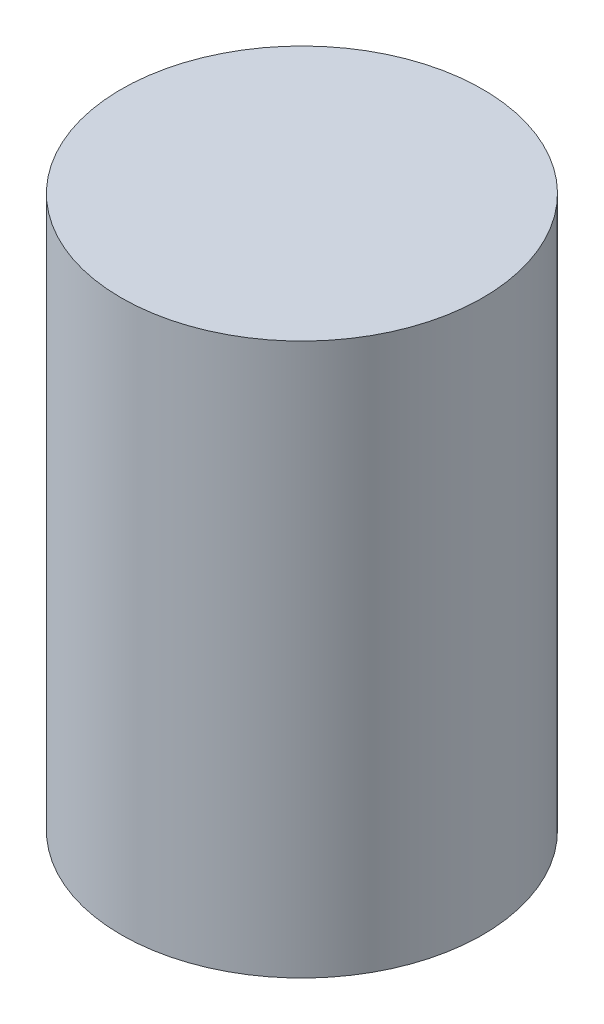
ISO-10303-21;
HEADER;
FILE_DESCRIPTION(('STEP AP214'),'2;1');
FILE_NAME('part.step','',(''),(''),'','','');
FILE_SCHEMA(('AUTOMOTIVE_DESIGN { 1 0 10303 214 1 1 1 1 }'));
ENDSEC;
DATA;
#1=APPLICATION_CONTEXT('core data for automotive mechanical design processes');
#2=APPLICATION_PROTOCOL_DEFINITION('international standard','automotive_design',2000,#1);
#3=PRODUCT_CONTEXT('',#1,'mechanical');
#4=PRODUCT('Part','Part','',(#3));
#5=PRODUCT_RELATED_PRODUCT_CATEGORY('part','',(#4));
#6=PRODUCT_DEFINITION_FORMATION('','',#4);
#7=PRODUCT_DEFINITION_CONTEXT('part definition',#1,'design');
#8=PRODUCT_DEFINITION('design','',#6,#7);
#9=PRODUCT_DEFINITION_SHAPE('','',#8);
#10=(LENGTH_UNIT() NAMED_UNIT(*) SI_UNIT(.MILLI.,.METRE.));
#11=(NAMED_UNIT(*) PLANE_ANGLE_UNIT() SI_UNIT($,.RADIAN.));
#12=(NAMED_UNIT(*) SI_UNIT($,.STERADIAN.) SOLID_ANGLE_UNIT());
#13=UNCERTAINTY_MEASURE_WITH_UNIT(LENGTH_MEASURE(1.E-05),#10,'distance_accuracy_value','');
#14=(GEOMETRIC_REPRESENTATION_CONTEXT(3) GLOBAL_UNCERTAINTY_ASSIGNED_CONTEXT((#13)) GLOBAL_UNIT_ASSIGNED_CONTEXT((#10,
#11,#12)) REPRESENTATION_CONTEXT('',''));
#15=CARTESIAN_POINT('',(0.,0.,0.));
#16=DIRECTION('',(0.,0.,1.));
#17=DIRECTION('',(1.,0.,0.));
#18=AXIS2_PLACEMENT_3D('',#15,#16,#17);
#19=CARTESIAN_POINT('',(0.,5.8,0.));
#20=DIRECTION('',(0.,-1.,0.));
#21=DIRECTION('',(0.,0.,-1.));
#22=AXIS2_PLACEMENT_3D('',#19,#20,#21);
#23=CYLINDRICAL_SURFACE('',#22,1.9);
#24=CARTESIAN_POINT('',(0.,5.8,0.));
#25=DIRECTION('',(0.,1.,0.));
#26=DIRECTION('',(0.,0.,1.));
#27=AXIS2_PLACEMENT_3D('',#24,#25,#26);
#28=CIRCLE('',#27,1.9);
#29=CARTESIAN_POINT('',(0.,5.8,1.9));
#30=VERTEX_POINT('',#29);
#31=EDGE_CURVE('E10',#30,#30,#28,.T.);
#32=ORIENTED_EDGE('',*,*,#31,.F.);
#33=EDGE_LOOP('',(#32));
#34=FACE_BOUND('',#33,.T.);
#35=CARTESIAN_POINT('',(0.,0.,0.));
#36=DIRECTION('',(0.,1.,0.));
#37=DIRECTION('',(0.,0.,1.));
#38=AXIS2_PLACEMENT_3D('',#35,#36,#37);
#39=CIRCLE('',#38,1.9);
#40=CARTESIAN_POINT('',(0.,0.,1.9));
#41=VERTEX_POINT('',#40);
#42=EDGE_CURVE('E34',#41,#41,#39,.T.);
#43=ORIENTED_EDGE('',*,*,#42,.T.);
#44=EDGE_LOOP('',(#43));
#45=FACE_BOUND('',#44,.T.);
#46=ADVANCED_FACE('F31',(#34,#45),#23,.T.);
#47=CARTESIAN_POINT('',(0.,5.8,0.));
#48=DIRECTION('',(0.,1.,0.));
#49=DIRECTION('',(0.,0.,1.));
#50=AXIS2_PLACEMENT_3D('',#47,#48,#49);
#51=PLANE('',#50);
#52=ORIENTED_EDGE('',*,*,#31,.T.);
#53=EDGE_LOOP('',(#52));
#54=FACE_BOUND('',#53,.T.);
#55=ADVANCED_FACE('F46',(#54),#51,.T.);
#56=CARTESIAN_POINT('',(0.,0.,0.));
#57=DIRECTION('',(0.,1.,0.));
#58=DIRECTION('',(0.,0.,1.));
#59=AXIS2_PLACEMENT_3D('',#56,#57,#58);
#60=PLANE('',#59);
#61=ORIENTED_EDGE('',*,*,#42,.F.);
#62=EDGE_LOOP('',(#61));
#63=FACE_BOUND('',#62,.T.);
#64=ADVANCED_FACE('F44',(#63),#60,.F.);
#65=CLOSED_SHELL('',(#46,#55,#64));
#66=MANIFOLD_SOLID_BREP('B2',#65);
#67=ADVANCED_BREP_SHAPE_REPRESENTATION('',(#18,#66),#14);
#68=SHAPE_DEFINITION_REPRESENTATION(#9,#67);
ENDSEC;
END-ISO-10303-21;
